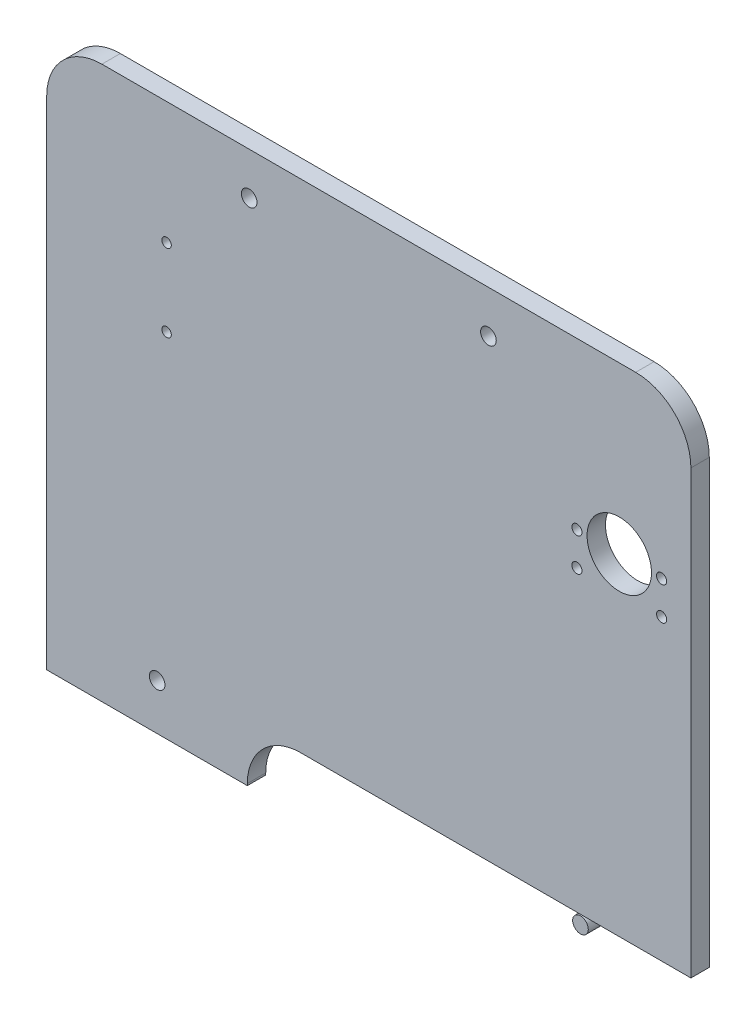
ISO-10303-21;
HEADER;
FILE_DESCRIPTION(('STEP AP214'),'2;1');
FILE_NAME('part.step','',(''),(''),'','','');
FILE_SCHEMA(('AUTOMOTIVE_DESIGN { 1 0 10303 214 1 1 1 1 }'));
ENDSEC;
DATA;
#1=APPLICATION_CONTEXT('core data for automotive mechanical design processes');
#2=APPLICATION_PROTOCOL_DEFINITION('international standard','automotive_design',2000,#1);
#3=PRODUCT_CONTEXT('',#1,'mechanical');
#4=PRODUCT('Part','Part','',(#3));
#5=PRODUCT_RELATED_PRODUCT_CATEGORY('part','',(#4));
#6=PRODUCT_DEFINITION_FORMATION('','',#4);
#7=PRODUCT_DEFINITION_CONTEXT('part definition',#1,'design');
#8=PRODUCT_DEFINITION('design','',#6,#7);
#9=PRODUCT_DEFINITION_SHAPE('','',#8);
#10=(LENGTH_UNIT() NAMED_UNIT(*) SI_UNIT(.MILLI.,.METRE.));
#11=(NAMED_UNIT(*) PLANE_ANGLE_UNIT() SI_UNIT($,.RADIAN.));
#12=(NAMED_UNIT(*) SI_UNIT($,.STERADIAN.) SOLID_ANGLE_UNIT());
#13=UNCERTAINTY_MEASURE_WITH_UNIT(LENGTH_MEASURE(1.E-05),#10,'distance_accuracy_value','');
#14=(GEOMETRIC_REPRESENTATION_CONTEXT(3) GLOBAL_UNCERTAINTY_ASSIGNED_CONTEXT((#13)) GLOBAL_UNIT_ASSIGNED_CONTEXT((#10,
#11,#12)) REPRESENTATION_CONTEXT('',''));
#15=CARTESIAN_POINT('',(0.,0.,0.));
#16=DIRECTION('',(0.,0.,1.));
#17=DIRECTION('',(1.,0.,0.));
#18=AXIS2_PLACEMENT_3D('',#15,#16,#17);
#19=CARTESIAN_POINT('',(-350.,0.,10.));
#20=DIRECTION('',(1.,0.,0.));
#21=DIRECTION('',(0.,0.,-1.));
#22=AXIS2_PLACEMENT_3D('',#19,#20,#21);
#23=PLANE('',#22);
#24=DIRECTION('',(0.,-1.,0.));
#25=VECTOR('',#24,1.);
#26=CARTESIAN_POINT('',(-350.,0.,10.));
#27=LINE('',#26,#25);
#28=CARTESIAN_POINT('',(-350.,270.,10.));
#29=VERTEX_POINT('',#28);
#30=CARTESIAN_POINT('',(-350.,0.,10.));
#31=VERTEX_POINT('',#30);
#32=EDGE_CURVE('E130',#29,#31,#27,.T.);
#33=ORIENTED_EDGE('',*,*,#32,.F.);
#34=DIRECTION('',(0.,0.,-1.));
#35=VECTOR('',#34,1.);
#36=CARTESIAN_POINT('',(-350.,270.,10.));
#37=LINE('',#36,#35);
#38=CARTESIAN_POINT('',(-350.,270.,0.));
#39=VERTEX_POINT('',#38);
#40=EDGE_CURVE('E135',#29,#39,#37,.T.);
#41=ORIENTED_EDGE('',*,*,#40,.T.);
#42=DIRECTION('',(0.,-1.,0.));
#43=VECTOR('',#42,1.);
#44=CARTESIAN_POINT('',(-350.,0.,0.));
#45=LINE('',#44,#43);
#46=CARTESIAN_POINT('',(-350.,0.,0.));
#47=VERTEX_POINT('',#46);
#48=EDGE_CURVE('E133',#39,#47,#45,.T.);
#49=ORIENTED_EDGE('',*,*,#48,.T.);
#50=DIRECTION('',(0.,0.,-1.));
#51=VECTOR('',#50,1.);
#52=CARTESIAN_POINT('',(-350.,0.,10.));
#53=LINE('',#52,#51);
#54=EDGE_CURVE('E120',#31,#47,#53,.T.);
#55=ORIENTED_EDGE('',*,*,#54,.F.);
#56=EDGE_LOOP('',(#33,#41,#49,#55));
#57=FACE_BOUND('',#56,.T.);
#58=ADVANCED_FACE('F42',(#57),#23,.F.);
#59=CARTESIAN_POINT('',(-350.,0.,10.));
#60=DIRECTION('',(0.,1.,0.));
#61=DIRECTION('',(0.,0.,1.));
#62=AXIS2_PLACEMENT_3D('',#59,#60,#61);
#63=PLANE('',#62);
#64=DIRECTION('',(1.,0.,0.));
#65=VECTOR('',#64,1.);
#66=CARTESIAN_POINT('',(-350.,0.,0.));
#67=LINE('',#66,#65);
#68=CARTESIAN_POINT('',(-241.,0.,0.));
#69=VERTEX_POINT('',#68);
#70=EDGE_CURVE('E121',#47,#69,#67,.T.);
#71=ORIENTED_EDGE('',*,*,#70,.T.);
#72=DIRECTION('',(0.,0.,1.));
#73=VECTOR('',#72,1.);
#74=CARTESIAN_POINT('',(-241.,0.,0.));
#75=LINE('',#74,#73);
#76=CARTESIAN_POINT('',(-241.,0.,10.));
#77=VERTEX_POINT('',#76);
#78=EDGE_CURVE('E113',#69,#77,#75,.T.);
#79=ORIENTED_EDGE('',*,*,#78,.T.);
#80=DIRECTION('',(1.,0.,0.));
#81=VECTOR('',#80,1.);
#82=CARTESIAN_POINT('',(-350.,0.,10.));
#83=LINE('',#82,#81);
#84=EDGE_CURVE('E148',#31,#77,#83,.T.);
#85=ORIENTED_EDGE('',*,*,#84,.F.);
#86=ORIENTED_EDGE('',*,*,#54,.T.);
#87=EDGE_LOOP('',(#71,#79,#85,#86));
#88=FACE_BOUND('',#87,.T.);
#89=ADVANCED_FACE('F131',(#88),#63,.F.);
#90=CARTESIAN_POINT('',(0.,0.,10.));
#91=DIRECTION('',(-1.,0.,0.));
#92=DIRECTION('',(0.,-1.,0.));
#93=AXIS2_PLACEMENT_3D('',#90,#91,#92);
#94=PLANE('',#93);
#95=DIRECTION('',(0.,1.,0.));
#96=VECTOR('',#95,1.);
#97=CARTESIAN_POINT('',(0.,0.,10.));
#98=LINE('',#97,#96);
#99=CARTESIAN_POINT('',(0.,30.,10.));
#100=VERTEX_POINT('',#99);
#101=CARTESIAN_POINT('',(0.,270.,10.));
#102=VERTEX_POINT('',#101);
#103=EDGE_CURVE('E146',#100,#102,#98,.T.);
#104=ORIENTED_EDGE('',*,*,#103,.F.);
#105=DIRECTION('',(0.,0.,-1.));
#106=VECTOR('',#105,1.);
#107=CARTESIAN_POINT('',(0.,30.,10.));
#108=LINE('',#107,#106);
#109=CARTESIAN_POINT('',(0.,30.,0.));
#110=VERTEX_POINT('',#109);
#111=EDGE_CURVE('E152',#100,#110,#108,.T.);
#112=ORIENTED_EDGE('',*,*,#111,.T.);
#113=DIRECTION('',(0.,1.,0.));
#114=VECTOR('',#113,1.);
#115=CARTESIAN_POINT('',(0.,0.,0.));
#116=LINE('',#115,#114);
#117=CARTESIAN_POINT('',(0.,270.,0.));
#118=VERTEX_POINT('',#117);
#119=EDGE_CURVE('E138',#110,#118,#116,.T.);
#120=ORIENTED_EDGE('',*,*,#119,.T.);
#121=DIRECTION('',(0.,0.,-1.));
#122=VECTOR('',#121,1.);
#123=CARTESIAN_POINT('',(0.,270.,10.));
#124=LINE('',#123,#122);
#125=EDGE_CURVE('E170',#118,#102,#124,.F.);
#126=ORIENTED_EDGE('',*,*,#125,.T.);
#127=EDGE_LOOP('',(#104,#112,#120,#126));
#128=FACE_BOUND('',#127,.T.);
#129=ADVANCED_FACE('F289',(#128),#94,.F.);
#130=CARTESIAN_POINT('',(-350.,300.,10.));
#131=DIRECTION('',(0.,-1.,0.));
#132=DIRECTION('',(1.,0.,0.));
#133=AXIS2_PLACEMENT_3D('',#130,#131,#132);
#134=PLANE('',#133);
#135=DIRECTION('',(-1.,0.,0.));
#136=VECTOR('',#135,1.);
#137=CARTESIAN_POINT('',(-350.,300.,10.));
#138=LINE('',#137,#136);
#139=CARTESIAN_POINT('',(-30.,300.,10.));
#140=VERTEX_POINT('',#139);
#141=CARTESIAN_POINT('',(-320.,300.,10.));
#142=VERTEX_POINT('',#141);
#143=EDGE_CURVE('E141',#140,#142,#138,.T.);
#144=ORIENTED_EDGE('',*,*,#143,.F.);
#145=DIRECTION('',(0.,0.,-1.));
#146=VECTOR('',#145,1.);
#147=CARTESIAN_POINT('',(-30.,300.,10.));
#148=LINE('',#147,#146);
#149=CARTESIAN_POINT('',(-30.,300.,0.));
#150=VERTEX_POINT('',#149);
#151=EDGE_CURVE('E173',#140,#150,#148,.T.);
#152=ORIENTED_EDGE('',*,*,#151,.T.);
#153=DIRECTION('',(-1.,0.,0.));
#154=VECTOR('',#153,1.);
#155=CARTESIAN_POINT('',(-350.,300.,0.));
#156=LINE('',#155,#154);
#157=CARTESIAN_POINT('',(-320.,300.,0.));
#158=VERTEX_POINT('',#157);
#159=EDGE_CURVE('E176',#150,#158,#156,.T.);
#160=ORIENTED_EDGE('',*,*,#159,.T.);
#161=DIRECTION('',(0.,0.,-1.));
#162=VECTOR('',#161,1.);
#163=CARTESIAN_POINT('',(-320.,300.,10.));
#164=LINE('',#163,#162);
#165=EDGE_CURVE('E150',#158,#142,#164,.F.);
#166=ORIENTED_EDGE('',*,*,#165,.T.);
#167=EDGE_LOOP('',(#144,#152,#160,#166));
#168=FACE_BOUND('',#167,.T.);
#169=ADVANCED_FACE('F182',(#168),#134,.F.);
#170=CARTESIAN_POINT('',(0.,0.,10.));
#171=DIRECTION('',(0.,0.,-1.));
#172=DIRECTION('',(-1.,0.,0.));
#173=AXIS2_PLACEMENT_3D('',#170,#171,#172);
#174=PLANE('',#173);
#175=CARTESIAN_POINT('',(-15.9131953939544,210.,10.));
#176=DIRECTION('',(0.,0.,1.));
#177=DIRECTION('',(1.,0.,0.));
#178=AXIS2_PLACEMENT_3D('',#175,#176,#177);
#179=CIRCLE('',#178,2.74999999999998);
#180=CARTESIAN_POINT('',(-13.1631953939544,210.,10.));
#181=VERTEX_POINT('',#180);
#182=EDGE_CURVE('E232',#181,#181,#179,.T.);
#183=ORIENTED_EDGE('',*,*,#182,.F.);
#184=EDGE_LOOP('',(#183));
#185=FACE_BOUND('',#184,.T.);
#186=CARTESIAN_POINT('',(-284.869,191.548,10.));
#187=DIRECTION('',(0.,0.,1.));
#188=DIRECTION('',(1.,0.,0.));
#189=AXIS2_PLACEMENT_3D('',#186,#187,#188);
#190=CIRCLE('',#189,2.55499999999999);
#191=CARTESIAN_POINT('',(-282.314,191.548,10.));
#192=VERTEX_POINT('',#191);
#193=EDGE_CURVE('E226',#192,#192,#190,.T.);
#194=ORIENTED_EDGE('',*,*,#193,.F.);
#195=EDGE_LOOP('',(#194));
#196=FACE_BOUND('',#195,.T.);
#197=CARTESIAN_POINT('',(-15.9131953939544,192.,10.));
#198=DIRECTION('',(0.,0.,1.));
#199=DIRECTION('',(1.,0.,0.));
#200=AXIS2_PLACEMENT_3D('',#197,#198,#199);
#201=CIRCLE('',#200,2.74999999999998);
#202=CARTESIAN_POINT('',(-13.1631953939544,192.,10.));
#203=VERTEX_POINT('',#202);
#204=EDGE_CURVE('E250',#203,#203,#201,.T.);
#205=ORIENTED_EDGE('',*,*,#204,.F.);
#206=EDGE_LOOP('',(#205));
#207=FACE_BOUND('',#206,.T.);
#208=CARTESIAN_POINT('',(-61.9131953939544,210.,10.));
#209=DIRECTION('',(0.,0.,1.));
#210=DIRECTION('',(1.,0.,0.));
#211=AXIS2_PLACEMENT_3D('',#208,#209,#210);
#212=CIRCLE('',#211,2.75000000000002);
#213=CARTESIAN_POINT('',(-59.1631953939544,210.,10.));
#214=VERTEX_POINT('',#213);
#215=EDGE_CURVE('E244',#214,#214,#212,.T.);
#216=ORIENTED_EDGE('',*,*,#215,.F.);
#217=EDGE_LOOP('',(#216));
#218=FACE_BOUND('',#217,.T.);
#219=CARTESIAN_POINT('',(-61.9131953939544,192.,10.));
#220=DIRECTION('',(0.,0.,1.));
#221=DIRECTION('',(1.,0.,0.));
#222=AXIS2_PLACEMENT_3D('',#219,#220,#221);
#223=CIRCLE('',#222,2.75000000000002);
#224=CARTESIAN_POINT('',(-59.1631953939544,192.,10.));
#225=VERTEX_POINT('',#224);
#226=EDGE_CURVE('E238',#225,#225,#223,.T.);
#227=ORIENTED_EDGE('',*,*,#226,.F.);
#228=EDGE_LOOP('',(#227));
#229=FACE_BOUND('',#228,.T.);
#230=CARTESIAN_POINT('',(-38.9131953939544,210.,10.));
#231=DIRECTION('',(0.,0.,1.));
#232=DIRECTION('',(1.,0.,0.));
#233=AXIS2_PLACEMENT_3D('',#230,#231,#232);
#234=CIRCLE('',#233,17.5);
#235=CARTESIAN_POINT('',(-21.4131953939544,210.,10.));
#236=VERTEX_POINT('',#235);
#237=EDGE_CURVE('E209',#236,#236,#234,.T.);
#238=ORIENTED_EDGE('',*,*,#237,.F.);
#239=EDGE_LOOP('',(#238));
#240=FACE_BOUND('',#239,.T.);
#241=CARTESIAN_POINT('',(-290.,25.,10.));
#242=DIRECTION('',(0.,0.,1.));
#243=DIRECTION('',(1.,0.,0.));
#244=AXIS2_PLACEMENT_3D('',#241,#242,#243);
#245=CIRCLE('',#244,4.25000000000001);
#246=CARTESIAN_POINT('',(-285.75,25.,10.));
#247=VERTEX_POINT('',#246);
#248=EDGE_CURVE('E203',#247,#247,#245,.T.);
#249=ORIENTED_EDGE('',*,*,#248,.F.);
#250=EDGE_LOOP('',(#249));
#251=FACE_BOUND('',#250,.T.);
#252=CARTESIAN_POINT('',(-240.,277.,10.));
#253=DIRECTION('',(0.,0.,1.));
#254=DIRECTION('',(1.,0.,0.));
#255=AXIS2_PLACEMENT_3D('',#252,#253,#254);
#256=CIRCLE('',#255,4.25000000000013);
#257=CARTESIAN_POINT('',(-235.75,277.,10.));
#258=VERTEX_POINT('',#257);
#259=EDGE_CURVE('E196',#258,#258,#256,.T.);
#260=ORIENTED_EDGE('',*,*,#259,.F.);
#261=EDGE_LOOP('',(#260));
#262=FACE_BOUND('',#261,.T.);
#263=CARTESIAN_POINT('',(-110.,277.,10.));
#264=DIRECTION('',(0.,0.,1.));
#265=DIRECTION('',(1.,0.,0.));
#266=AXIS2_PLACEMENT_3D('',#263,#264,#265);
#267=CIRCLE('',#266,4.25000000000001);
#268=CARTESIAN_POINT('',(-105.75,277.,10.));
#269=VERTEX_POINT('',#268);
#270=EDGE_CURVE('E221',#269,#269,#267,.T.);
#271=ORIENTED_EDGE('',*,*,#270,.F.);
#272=EDGE_LOOP('',(#271));
#273=FACE_BOUND('',#272,.T.);
#274=CARTESIAN_POINT('',(-284.869,233.567,10.));
#275=DIRECTION('',(0.,0.,1.));
#276=DIRECTION('',(1.,0.,0.));
#277=AXIS2_PLACEMENT_3D('',#274,#275,#276);
#278=CIRCLE('',#277,2.55499999999999);
#279=CARTESIAN_POINT('',(-282.314,233.567,10.));
#280=VERTEX_POINT('',#279);
#281=EDGE_CURVE('E214',#280,#280,#278,.T.);
#282=ORIENTED_EDGE('',*,*,#281,.F.);
#283=EDGE_LOOP('',(#282));
#284=FACE_BOUND('',#283,.T.);
#285=ORIENTED_EDGE('',*,*,#84,.T.);
#286=DIRECTION('',(0.,-1.,0.));
#287=VECTOR('',#286,1.);
#288=CARTESIAN_POINT('',(-241.,0.,10.));
#289=LINE('',#288,#287);
#290=CARTESIAN_POINT('',(-241.,1.00000000000006,10.));
#291=VERTEX_POINT('',#290);
#292=EDGE_CURVE('E110',#291,#77,#289,.T.);
#293=ORIENTED_EDGE('',*,*,#292,.F.);
#294=CARTESIAN_POINT('',(-212.,1.00000000000006,10.));
#295=DIRECTION('',(0.,0.,1.));
#296=DIRECTION('',(-1.,0.,0.));
#297=AXIS2_PLACEMENT_3D('',#294,#295,#296);
#298=CIRCLE('',#297,28.9999999999999);
#299=CARTESIAN_POINT('',(-212.,30.,10.));
#300=VERTEX_POINT('',#299);
#301=EDGE_CURVE('E52',#300,#291,#298,.T.);
#302=ORIENTED_EDGE('',*,*,#301,.F.);
#303=DIRECTION('',(-1.,0.,0.));
#304=VECTOR('',#303,1.);
#305=CARTESIAN_POINT('',(-212.,30.,10.));
#306=LINE('',#305,#304);
#307=EDGE_CURVE('E159',#100,#300,#306,.T.);
#308=ORIENTED_EDGE('',*,*,#307,.F.);
#309=ORIENTED_EDGE('',*,*,#103,.T.);
#310=CARTESIAN_POINT('',(-30.,270.,10.));
#311=DIRECTION('',(0.,0.,-1.));
#312=DIRECTION('',(-1.,0.,0.));
#313=AXIS2_PLACEMENT_3D('',#310,#311,#312);
#314=CIRCLE('',#313,30.);
#315=EDGE_CURVE('E145',#102,#140,#314,.F.);
#316=ORIENTED_EDGE('',*,*,#315,.T.);
#317=ORIENTED_EDGE('',*,*,#143,.T.);
#318=CARTESIAN_POINT('',(-320.,270.,10.));
#319=DIRECTION('',(0.,0.,-1.));
#320=DIRECTION('',(-1.,0.,0.));
#321=AXIS2_PLACEMENT_3D('',#318,#319,#320);
#322=CIRCLE('',#321,30.);
#323=EDGE_CURVE('E144',#142,#29,#322,.F.);
#324=ORIENTED_EDGE('',*,*,#323,.T.);
#325=ORIENTED_EDGE('',*,*,#32,.T.);
#326=EDGE_LOOP('',(#285,#293,#302,#308,#309,#316,#317,#324,#325));
#327=FACE_BOUND('',#326,.T.);
#328=ADVANCED_FACE('F44',(#185,#196,#207,#218,#229,#240,#251,#262,#273,#284,#327),#174,.F.);
#329=CARTESIAN_POINT('',(0.,0.,0.));
#330=DIRECTION('',(0.,0.,-1.));
#331=DIRECTION('',(-1.,0.,0.));
#332=AXIS2_PLACEMENT_3D('',#329,#330,#331);
#333=PLANE('',#332);
#334=CARTESIAN_POINT('',(-15.9131953939544,210.,0.));
#335=DIRECTION('',(0.,0.,1.));
#336=DIRECTION('',(1.,0.,0.));
#337=AXIS2_PLACEMENT_3D('',#334,#335,#336);
#338=CIRCLE('',#337,2.74999999999998);
#339=CARTESIAN_POINT('',(-13.1631953939544,210.,0.));
#340=VERTEX_POINT('',#339);
#341=EDGE_CURVE('E229',#340,#340,#338,.T.);
#342=ORIENTED_EDGE('',*,*,#341,.T.);
#343=EDGE_LOOP('',(#342));
#344=FACE_BOUND('',#343,.T.);
#345=CARTESIAN_POINT('',(-284.869,191.548,0.));
#346=DIRECTION('',(0.,0.,1.));
#347=DIRECTION('',(1.,0.,0.));
#348=AXIS2_PLACEMENT_3D('',#345,#346,#347);
#349=CIRCLE('',#348,2.55499999999999);
#350=CARTESIAN_POINT('',(-282.314,191.548,0.));
#351=VERTEX_POINT('',#350);
#352=EDGE_CURVE('E218',#351,#351,#349,.T.);
#353=ORIENTED_EDGE('',*,*,#352,.T.);
#354=EDGE_LOOP('',(#353));
#355=FACE_BOUND('',#354,.T.);
#356=CARTESIAN_POINT('',(-15.9131953939544,192.,0.));
#357=DIRECTION('',(0.,0.,1.));
#358=DIRECTION('',(1.,0.,0.));
#359=AXIS2_PLACEMENT_3D('',#356,#357,#358);
#360=CIRCLE('',#359,2.74999999999998);
#361=CARTESIAN_POINT('',(-13.1631953939544,192.,0.));
#362=VERTEX_POINT('',#361);
#363=EDGE_CURVE('E235',#362,#362,#360,.T.);
#364=ORIENTED_EDGE('',*,*,#363,.T.);
#365=EDGE_LOOP('',(#364));
#366=FACE_BOUND('',#365,.T.);
#367=CARTESIAN_POINT('',(-61.9131953939544,210.,0.));
#368=DIRECTION('',(0.,0.,1.));
#369=DIRECTION('',(1.,0.,0.));
#370=AXIS2_PLACEMENT_3D('',#367,#368,#369);
#371=CIRCLE('',#370,2.75000000000002);
#372=CARTESIAN_POINT('',(-59.1631953939544,210.,0.));
#373=VERTEX_POINT('',#372);
#374=EDGE_CURVE('E247',#373,#373,#371,.T.);
#375=ORIENTED_EDGE('',*,*,#374,.T.);
#376=EDGE_LOOP('',(#375));
#377=FACE_BOUND('',#376,.T.);
#378=CARTESIAN_POINT('',(-61.9131953939544,192.,0.));
#379=DIRECTION('',(0.,0.,1.));
#380=DIRECTION('',(1.,0.,0.));
#381=AXIS2_PLACEMENT_3D('',#378,#379,#380);
#382=CIRCLE('',#381,2.75000000000002);
#383=CARTESIAN_POINT('',(-59.1631953939544,192.,0.));
#384=VERTEX_POINT('',#383);
#385=EDGE_CURVE('E241',#384,#384,#382,.T.);
#386=ORIENTED_EDGE('',*,*,#385,.T.);
#387=EDGE_LOOP('',(#386));
#388=FACE_BOUND('',#387,.T.);
#389=CARTESIAN_POINT('',(-38.9131953939544,210.,0.));
#390=DIRECTION('',(0.,0.,1.));
#391=DIRECTION('',(1.,0.,0.));
#392=AXIS2_PLACEMENT_3D('',#389,#390,#391);
#393=CIRCLE('',#392,17.5);
#394=CARTESIAN_POINT('',(-21.4131953939544,210.,0.));
#395=VERTEX_POINT('',#394);
#396=EDGE_CURVE('E194',#395,#395,#393,.T.);
#397=ORIENTED_EDGE('',*,*,#396,.T.);
#398=EDGE_LOOP('',(#397));
#399=FACE_BOUND('',#398,.T.);
#400=CARTESIAN_POINT('',(-290.,25.,0.));
#401=DIRECTION('',(0.,0.,1.));
#402=DIRECTION('',(1.,0.,0.));
#403=AXIS2_PLACEMENT_3D('',#400,#401,#402);
#404=CIRCLE('',#403,4.25000000000001);
#405=CARTESIAN_POINT('',(-285.75,25.,0.));
#406=VERTEX_POINT('',#405);
#407=EDGE_CURVE('E206',#406,#406,#404,.T.);
#408=ORIENTED_EDGE('',*,*,#407,.T.);
#409=EDGE_LOOP('',(#408));
#410=FACE_BOUND('',#409,.T.);
#411=CARTESIAN_POINT('',(-240.,277.,0.));
#412=DIRECTION('',(0.,0.,1.));
#413=DIRECTION('',(1.,0.,0.));
#414=AXIS2_PLACEMENT_3D('',#411,#412,#413);
#415=CIRCLE('',#414,4.25000000000013);
#416=CARTESIAN_POINT('',(-235.75,277.,0.));
#417=VERTEX_POINT('',#416);
#418=EDGE_CURVE('E199',#417,#417,#415,.T.);
#419=ORIENTED_EDGE('',*,*,#418,.T.);
#420=EDGE_LOOP('',(#419));
#421=FACE_BOUND('',#420,.T.);
#422=CARTESIAN_POINT('',(-110.,277.,0.));
#423=DIRECTION('',(0.,0.,1.));
#424=DIRECTION('',(1.,0.,0.));
#425=AXIS2_PLACEMENT_3D('',#422,#423,#424);
#426=CIRCLE('',#425,4.25000000000001);
#427=CARTESIAN_POINT('',(-105.75,277.,0.));
#428=VERTEX_POINT('',#427);
#429=EDGE_CURVE('E200',#428,#428,#426,.T.);
#430=ORIENTED_EDGE('',*,*,#429,.T.);
#431=EDGE_LOOP('',(#430));
#432=FACE_BOUND('',#431,.T.);
#433=CARTESIAN_POINT('',(-284.869,233.567,0.));
#434=DIRECTION('',(0.,0.,1.));
#435=DIRECTION('',(1.,0.,0.));
#436=AXIS2_PLACEMENT_3D('',#433,#434,#435);
#437=CIRCLE('',#436,2.55499999999999);
#438=CARTESIAN_POINT('',(-282.314,233.567,0.));
#439=VERTEX_POINT('',#438);
#440=EDGE_CURVE('E217',#439,#439,#437,.T.);
#441=ORIENTED_EDGE('',*,*,#440,.T.);
#442=EDGE_LOOP('',(#441));
#443=FACE_BOUND('',#442,.T.);
#444=DIRECTION('',(0.,-1.,0.));
#445=VECTOR('',#444,1.);
#446=CARTESIAN_POINT('',(-241.,0.,0.));
#447=LINE('',#446,#445);
#448=CARTESIAN_POINT('',(-241.,1.00000000000006,0.));
#449=VERTEX_POINT('',#448);
#450=EDGE_CURVE('E46',#449,#69,#447,.T.);
#451=ORIENTED_EDGE('',*,*,#450,.T.);
#452=ORIENTED_EDGE('',*,*,#70,.F.);
#453=ORIENTED_EDGE('',*,*,#48,.F.);
#454=CARTESIAN_POINT('',(-320.,270.,0.));
#455=DIRECTION('',(0.,0.,-1.));
#456=DIRECTION('',(-1.,0.,0.));
#457=AXIS2_PLACEMENT_3D('',#454,#455,#456);
#458=CIRCLE('',#457,30.);
#459=EDGE_CURVE('E129',#39,#158,#458,.T.);
#460=ORIENTED_EDGE('',*,*,#459,.T.);
#461=ORIENTED_EDGE('',*,*,#159,.F.);
#462=CARTESIAN_POINT('',(-30.,270.,0.));
#463=DIRECTION('',(0.,0.,-1.));
#464=DIRECTION('',(-1.,0.,0.));
#465=AXIS2_PLACEMENT_3D('',#462,#463,#464);
#466=CIRCLE('',#465,30.);
#467=EDGE_CURVE('E162',#150,#118,#466,.T.);
#468=ORIENTED_EDGE('',*,*,#467,.T.);
#469=ORIENTED_EDGE('',*,*,#119,.F.);
#470=DIRECTION('',(1.,0.,0.));
#471=VECTOR('',#470,1.);
#472=CARTESIAN_POINT('',(0.,30.,0.));
#473=LINE('',#472,#471);
#474=CARTESIAN_POINT('',(-212.,30.,0.));
#475=VERTEX_POINT('',#474);
#476=EDGE_CURVE('E161',#475,#110,#473,.T.);
#477=ORIENTED_EDGE('',*,*,#476,.F.);
#478=CARTESIAN_POINT('',(-212.,1.00000000000006,0.));
#479=DIRECTION('',(0.,0.,1.));
#480=DIRECTION('',(-1.,0.,0.));
#481=AXIS2_PLACEMENT_3D('',#478,#479,#480);
#482=CIRCLE('',#481,28.9999999999999);
#483=EDGE_CURVE('E60',#475,#449,#482,.T.);
#484=ORIENTED_EDGE('',*,*,#483,.T.);
#485=EDGE_LOOP('',(#451,#452,#453,#460,#461,#468,#469,#477,#484));
#486=FACE_BOUND('',#485,.T.);
#487=ADVANCED_FACE('F125',(#344,#355,#366,#377,#388,#399,#410,#421,#432,#443,#486),#333,.T.);
#488=CARTESIAN_POINT('',(-30.,270.,10.));
#489=DIRECTION('',(0.,0.,-1.));
#490=DIRECTION('',(-1.,0.,0.));
#491=AXIS2_PLACEMENT_3D('',#488,#489,#490);
#492=CYLINDRICAL_SURFACE('',#491,30.);
#493=ORIENTED_EDGE('',*,*,#315,.F.);
#494=ORIENTED_EDGE('',*,*,#125,.F.);
#495=ORIENTED_EDGE('',*,*,#467,.F.);
#496=ORIENTED_EDGE('',*,*,#151,.F.);
#497=EDGE_LOOP('',(#493,#494,#495,#496));
#498=FACE_BOUND('',#497,.T.);
#499=ADVANCED_FACE('F292',(#498),#492,.T.);
#500=CARTESIAN_POINT('',(-320.,270.,10.));
#501=DIRECTION('',(0.,0.,-1.));
#502=DIRECTION('',(-1.,0.,0.));
#503=AXIS2_PLACEMENT_3D('',#500,#501,#502);
#504=CYLINDRICAL_SURFACE('',#503,30.);
#505=ORIENTED_EDGE('',*,*,#323,.F.);
#506=ORIENTED_EDGE('',*,*,#165,.F.);
#507=ORIENTED_EDGE('',*,*,#459,.F.);
#508=ORIENTED_EDGE('',*,*,#40,.F.);
#509=EDGE_LOOP('',(#505,#506,#507,#508));
#510=FACE_BOUND('',#509,.T.);
#511=ADVANCED_FACE('F186',(#510),#504,.T.);
#512=CARTESIAN_POINT('',(-212.,30.,0.));
#513=DIRECTION('',(0.,1.,0.));
#514=DIRECTION('',(0.,0.,1.));
#515=AXIS2_PLACEMENT_3D('',#512,#513,#514);
#516=PLANE('',#515);
#517=ORIENTED_EDGE('',*,*,#307,.T.);
#518=DIRECTION('',(0.,0.,1.));
#519=VECTOR('',#518,1.);
#520=CARTESIAN_POINT('',(-212.,30.,0.));
#521=LINE('',#520,#519);
#522=EDGE_CURVE('E12',#475,#300,#521,.T.);
#523=ORIENTED_EDGE('',*,*,#522,.F.);
#524=ORIENTED_EDGE('',*,*,#476,.T.);
#525=ORIENTED_EDGE('',*,*,#111,.F.);
#526=EDGE_LOOP('',(#517,#523,#524,#525));
#527=FACE_BOUND('',#526,.T.);
#528=ADVANCED_FACE('F303',(#527),#516,.F.);
#529=CARTESIAN_POINT('',(-241.,0.,0.));
#530=DIRECTION('',(-1.,0.,0.));
#531=DIRECTION('',(0.,0.,1.));
#532=AXIS2_PLACEMENT_3D('',#529,#530,#531);
#533=PLANE('',#532);
#534=ORIENTED_EDGE('',*,*,#292,.T.);
#535=ORIENTED_EDGE('',*,*,#78,.F.);
#536=ORIENTED_EDGE('',*,*,#450,.F.);
#537=DIRECTION('',(0.,0.,1.));
#538=VECTOR('',#537,1.);
#539=CARTESIAN_POINT('',(-241.,1.00000000000006,0.));
#540=LINE('',#539,#538);
#541=EDGE_CURVE('E155',#449,#291,#540,.T.);
#542=ORIENTED_EDGE('',*,*,#541,.T.);
#543=EDGE_LOOP('',(#534,#535,#536,#542));
#544=FACE_BOUND('',#543,.T.);
#545=ADVANCED_FACE('F115',(#544),#533,.F.);
#546=CARTESIAN_POINT('',(-212.,1.00000000000006,0.));
#547=DIRECTION('',(0.,0.,1.));
#548=DIRECTION('',(1.,0.,0.));
#549=AXIS2_PLACEMENT_3D('',#546,#547,#548);
#550=CYLINDRICAL_SURFACE('',#549,28.9999999999999);
#551=ORIENTED_EDGE('',*,*,#301,.T.);
#552=ORIENTED_EDGE('',*,*,#541,.F.);
#553=ORIENTED_EDGE('',*,*,#483,.F.);
#554=ORIENTED_EDGE('',*,*,#522,.T.);
#555=EDGE_LOOP('',(#551,#552,#553,#554));
#556=FACE_BOUND('',#555,.T.);
#557=ADVANCED_FACE('F302',(#556),#550,.F.);
#558=CARTESIAN_POINT('',(-284.869,233.567,0.));
#559=DIRECTION('',(0.,0.,1.));
#560=DIRECTION('',(1.,0.,0.));
#561=AXIS2_PLACEMENT_3D('',#558,#559,#560);
#562=CYLINDRICAL_SURFACE('',#561,2.55499999999999);
#563=ORIENTED_EDGE('',*,*,#440,.F.);
#564=EDGE_LOOP('',(#563));
#565=FACE_BOUND('',#564,.T.);
#566=ORIENTED_EDGE('',*,*,#281,.T.);
#567=EDGE_LOOP('',(#566));
#568=FACE_BOUND('',#567,.T.);
#569=ADVANCED_FACE('F308',(#565,#568),#562,.F.);
#570=CARTESIAN_POINT('',(-110.,277.,0.));
#571=DIRECTION('',(0.,0.,1.));
#572=DIRECTION('',(1.,0.,0.));
#573=AXIS2_PLACEMENT_3D('',#570,#571,#572);
#574=CYLINDRICAL_SURFACE('',#573,4.25000000000001);
#575=ORIENTED_EDGE('',*,*,#429,.F.);
#576=EDGE_LOOP('',(#575));
#577=FACE_BOUND('',#576,.T.);
#578=ORIENTED_EDGE('',*,*,#270,.T.);
#579=EDGE_LOOP('',(#578));
#580=FACE_BOUND('',#579,.T.);
#581=ADVANCED_FACE('F332',(#577,#580),#574,.F.);
#582=CARTESIAN_POINT('',(-240.,277.,0.));
#583=DIRECTION('',(0.,0.,1.));
#584=DIRECTION('',(1.,0.,0.));
#585=AXIS2_PLACEMENT_3D('',#582,#583,#584);
#586=CYLINDRICAL_SURFACE('',#585,4.25000000000013);
#587=ORIENTED_EDGE('',*,*,#418,.F.);
#588=EDGE_LOOP('',(#587));
#589=FACE_BOUND('',#588,.T.);
#590=ORIENTED_EDGE('',*,*,#259,.T.);
#591=EDGE_LOOP('',(#590));
#592=FACE_BOUND('',#591,.T.);
#593=ADVANCED_FACE('F335',(#589,#592),#586,.F.);
#594=CARTESIAN_POINT('',(-290.,25.,0.));
#595=DIRECTION('',(0.,0.,1.));
#596=DIRECTION('',(1.,0.,0.));
#597=AXIS2_PLACEMENT_3D('',#594,#595,#596);
#598=CYLINDRICAL_SURFACE('',#597,4.25000000000001);
#599=ORIENTED_EDGE('',*,*,#407,.F.);
#600=EDGE_LOOP('',(#599));
#601=FACE_BOUND('',#600,.T.);
#602=ORIENTED_EDGE('',*,*,#248,.T.);
#603=EDGE_LOOP('',(#602));
#604=FACE_BOUND('',#603,.T.);
#605=ADVANCED_FACE('F344',(#601,#604),#598,.F.);
#606=CARTESIAN_POINT('',(-38.9131953939544,210.,0.));
#607=DIRECTION('',(0.,0.,1.));
#608=DIRECTION('',(1.,0.,0.));
#609=AXIS2_PLACEMENT_3D('',#606,#607,#608);
#610=CYLINDRICAL_SURFACE('',#609,17.5);
#611=ORIENTED_EDGE('',*,*,#396,.F.);
#612=EDGE_LOOP('',(#611));
#613=FACE_BOUND('',#612,.T.);
#614=ORIENTED_EDGE('',*,*,#237,.T.);
#615=EDGE_LOOP('',(#614));
#616=FACE_BOUND('',#615,.T.);
#617=ADVANCED_FACE('F340',(#613,#616),#610,.F.);
#618=CARTESIAN_POINT('',(-61.9131953939544,192.,0.));
#619=DIRECTION('',(0.,0.,1.));
#620=DIRECTION('',(1.,0.,0.));
#621=AXIS2_PLACEMENT_3D('',#618,#619,#620);
#622=CYLINDRICAL_SURFACE('',#621,2.75000000000002);
#623=ORIENTED_EDGE('',*,*,#385,.F.);
#624=EDGE_LOOP('',(#623));
#625=FACE_BOUND('',#624,.T.);
#626=ORIENTED_EDGE('',*,*,#226,.T.);
#627=EDGE_LOOP('',(#626));
#628=FACE_BOUND('',#627,.T.);
#629=ADVANCED_FACE('F343',(#625,#628),#622,.F.);
#630=CARTESIAN_POINT('',(-61.9131953939544,210.,0.));
#631=DIRECTION('',(0.,0.,1.));
#632=DIRECTION('',(1.,0.,0.));
#633=AXIS2_PLACEMENT_3D('',#630,#631,#632);
#634=CYLINDRICAL_SURFACE('',#633,2.75000000000002);
#635=ORIENTED_EDGE('',*,*,#374,.F.);
#636=EDGE_LOOP('',(#635));
#637=FACE_BOUND('',#636,.T.);
#638=ORIENTED_EDGE('',*,*,#215,.T.);
#639=EDGE_LOOP('',(#638));
#640=FACE_BOUND('',#639,.T.);
#641=ADVANCED_FACE('F262',(#637,#640),#634,.F.);
#642=CARTESIAN_POINT('',(-15.9131953939544,192.,0.));
#643=DIRECTION('',(0.,0.,1.));
#644=DIRECTION('',(1.,0.,0.));
#645=AXIS2_PLACEMENT_3D('',#642,#643,#644);
#646=CYLINDRICAL_SURFACE('',#645,2.74999999999998);
#647=ORIENTED_EDGE('',*,*,#363,.F.);
#648=EDGE_LOOP('',(#647));
#649=FACE_BOUND('',#648,.T.);
#650=ORIENTED_EDGE('',*,*,#204,.T.);
#651=EDGE_LOOP('',(#650));
#652=FACE_BOUND('',#651,.T.);
#653=ADVANCED_FACE('F258',(#649,#652),#646,.F.);
#654=CARTESIAN_POINT('',(-284.869,191.548,0.));
#655=DIRECTION('',(0.,0.,1.));
#656=DIRECTION('',(1.,0.,0.));
#657=AXIS2_PLACEMENT_3D('',#654,#655,#656);
#658=CYLINDRICAL_SURFACE('',#657,2.55499999999999);
#659=ORIENTED_EDGE('',*,*,#352,.F.);
#660=EDGE_LOOP('',(#659));
#661=FACE_BOUND('',#660,.T.);
#662=ORIENTED_EDGE('',*,*,#193,.T.);
#663=EDGE_LOOP('',(#662));
#664=FACE_BOUND('',#663,.T.);
#665=ADVANCED_FACE('F261',(#661,#664),#658,.F.);
#666=CARTESIAN_POINT('',(-15.9131953939544,210.,0.));
#667=DIRECTION('',(0.,0.,1.));
#668=DIRECTION('',(1.,0.,0.));
#669=AXIS2_PLACEMENT_3D('',#666,#667,#668);
#670=CYLINDRICAL_SURFACE('',#669,2.74999999999998);
#671=ORIENTED_EDGE('',*,*,#341,.F.);
#672=EDGE_LOOP('',(#671));
#673=FACE_BOUND('',#672,.T.);
#674=ORIENTED_EDGE('',*,*,#182,.T.);
#675=EDGE_LOOP('',(#674));
#676=FACE_BOUND('',#675,.T.);
#677=ADVANCED_FACE('F321',(#673,#676),#670,.F.);
#678=CLOSED_SHELL('',(#58,#89,#129,#169,#328,#487,#499,#511,#528,#545,#557,#569,#581,#593,#605,
#617,#629,#641,#653,#665,#677));
#679=MANIFOLD_SOLID_BREP('B2',#678);
#680=CARTESIAN_POINT('',(0.,0.,0.));
#681=DIRECTION('',(0.,0.,-1.));
#682=DIRECTION('',(-1.,0.,0.));
#683=AXIS2_PLACEMENT_3D('',#680,#681,#682);
#684=PLANE('',#683);
#685=CARTESIAN_POINT('',(-59.9999999999999,25.,0.));
#686=DIRECTION('',(0.,0.,1.));
#687=DIRECTION('',(1.,0.,0.));
#688=AXIS2_PLACEMENT_3D('',#685,#686,#687);
#689=CIRCLE('',#688,4.25000000000001);
#690=CARTESIAN_POINT('',(-55.7499999999999,25.,0.));
#691=VERTEX_POINT('',#690);
#692=EDGE_CURVE('E41',#691,#691,#689,.T.);
#693=ORIENTED_EDGE('',*,*,#692,.F.);
#694=EDGE_LOOP('',(#693));
#695=FACE_BOUND('',#694,.T.);
#696=ADVANCED_FACE('F519',(#695),#684,.T.);
#697=CARTESIAN_POINT('',(-59.9999999999999,25.,0.));
#698=DIRECTION('',(0.,0.,1.));
#699=DIRECTION('',(1.,0.,0.));
#700=AXIS2_PLACEMENT_3D('',#697,#698,#699);
#701=CYLINDRICAL_SURFACE('',#700,4.25000000000001);
#702=ORIENTED_EDGE('',*,*,#692,.T.);
#703=EDGE_LOOP('',(#702));
#704=FACE_BOUND('',#703,.T.);
#705=CARTESIAN_POINT('',(-59.9999999999999,25.,10.));
#706=DIRECTION('',(0.,0.,1.));
#707=DIRECTION('',(1.,0.,0.));
#708=AXIS2_PLACEMENT_3D('',#705,#706,#707);
#709=CIRCLE('',#708,4.25000000000001);
#710=CARTESIAN_POINT('',(-55.7499999999999,25.,10.));
#711=VERTEX_POINT('',#710);
#712=EDGE_CURVE('E522',#711,#711,#709,.T.);
#713=ORIENTED_EDGE('',*,*,#712,.F.);
#714=EDGE_LOOP('',(#713));
#715=FACE_BOUND('',#714,.T.);
#716=ADVANCED_FACE('F533',(#704,#715),#701,.T.);
#717=CARTESIAN_POINT('',(0.,0.,10.));
#718=DIRECTION('',(0.,0.,-1.));
#719=DIRECTION('',(-1.,0.,0.));
#720=AXIS2_PLACEMENT_3D('',#717,#718,#719);
#721=PLANE('',#720);
#722=ORIENTED_EDGE('',*,*,#712,.T.);
#723=EDGE_LOOP('',(#722));
#724=FACE_BOUND('',#723,.T.);
#725=ADVANCED_FACE('F531',(#724),#721,.F.);
#726=CLOSED_SHELL('',(#696,#716,#725));
#727=MANIFOLD_SOLID_BREP('B6',#726);
#728=ADVANCED_BREP_SHAPE_REPRESENTATION('',(#18,#679,#727),#14);
#729=SHAPE_DEFINITION_REPRESENTATION(#9,#728);
ENDSEC;
END-ISO-10303-21;
